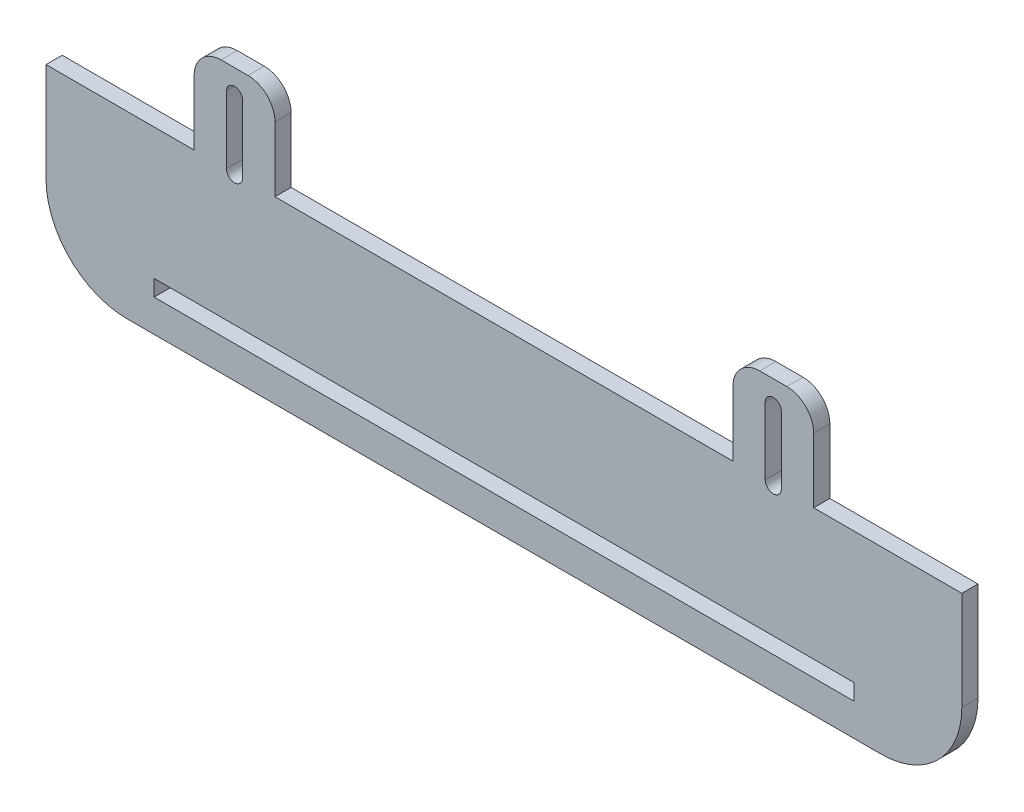
ISO-10303-21;
HEADER;
FILE_DESCRIPTION(('STEP AP214'),'2;1');
FILE_NAME('part.step','',(''),(''),'','','');
FILE_SCHEMA(('AUTOMOTIVE_DESIGN { 1 0 10303 214 1 1 1 1 }'));
ENDSEC;
DATA;
#1=APPLICATION_CONTEXT('core data for automotive mechanical design processes');
#2=APPLICATION_PROTOCOL_DEFINITION('international standard','automotive_design',2000,#1);
#3=PRODUCT_CONTEXT('',#1,'mechanical');
#4=PRODUCT('Part','Part','',(#3));
#5=PRODUCT_RELATED_PRODUCT_CATEGORY('part','',(#4));
#6=PRODUCT_DEFINITION_FORMATION('','',#4);
#7=PRODUCT_DEFINITION_CONTEXT('part definition',#1,'design');
#8=PRODUCT_DEFINITION('design','',#6,#7);
#9=PRODUCT_DEFINITION_SHAPE('','',#8);
#10=(LENGTH_UNIT() NAMED_UNIT(*) SI_UNIT(.MILLI.,.METRE.));
#11=(NAMED_UNIT(*) PLANE_ANGLE_UNIT() SI_UNIT($,.RADIAN.));
#12=(NAMED_UNIT(*) SI_UNIT($,.STERADIAN.) SOLID_ANGLE_UNIT());
#13=UNCERTAINTY_MEASURE_WITH_UNIT(LENGTH_MEASURE(1.E-05),#10,'distance_accuracy_value','');
#14=(GEOMETRIC_REPRESENTATION_CONTEXT(3) GLOBAL_UNCERTAINTY_ASSIGNED_CONTEXT((#13)) GLOBAL_UNIT_ASSIGNED_CONTEXT((#10,
#11,#12)) REPRESENTATION_CONTEXT('',''));
#15=CARTESIAN_POINT('',(0.,0.,0.));
#16=DIRECTION('',(0.,0.,1.));
#17=DIRECTION('',(1.,0.,0.));
#18=AXIS2_PLACEMENT_3D('',#15,#16,#17);
#19=CARTESIAN_POINT('',(-73.622208541519,-61.5984861008832,3.));
#20=DIRECTION('',(0.,0.,-1.));
#21=DIRECTION('',(-1.,0.,0.));
#22=AXIS2_PLACEMENT_3D('',#19,#20,#21);
#23=PLANE('',#22);
#24=DIRECTION('',(1.,0.,0.));
#25=VECTOR('',#24,1.);
#26=CARTESIAN_POINT('',(61.3152833659331,-70.5984861008832,3.));
#27=LINE('',#26,#25);
#28=CARTESIAN_POINT('',(-68.5597004489711,-70.5984861008832,3.));
#29=VERTEX_POINT('',#28);
#30=CARTESIAN_POINT('',(61.3152833659331,-70.5984861008832,3.));
#31=VERTEX_POINT('',#30);
#32=EDGE_CURVE('E251',#29,#31,#27,.T.);
#33=ORIENTED_EDGE('',*,*,#32,.F.);
#34=DIRECTION('',(0.,-1.,0.));
#35=VECTOR('',#34,1.);
#36=CARTESIAN_POINT('',(-68.5597004489711,-67.5984861008832,3.));
#37=LINE('',#36,#35);
#38=CARTESIAN_POINT('',(-68.5597004489711,-67.5984861008832,3.));
#39=VERTEX_POINT('',#38);
#40=EDGE_CURVE('E57',#39,#29,#37,.T.);
#41=ORIENTED_EDGE('',*,*,#40,.F.);
#42=DIRECTION('',(-1.,0.,0.));
#43=VECTOR('',#42,1.);
#44=CARTESIAN_POINT('',(61.3152833659331,-67.5984861008832,3.));
#45=LINE('',#44,#43);
#46=CARTESIAN_POINT('',(61.3152833659331,-67.5984861008832,3.));
#47=VERTEX_POINT('',#46);
#48=EDGE_CURVE('E258',#47,#39,#45,.T.);
#49=ORIENTED_EDGE('',*,*,#48,.F.);
#50=DIRECTION('',(0.,1.,0.));
#51=VECTOR('',#50,1.);
#52=CARTESIAN_POINT('',(61.3152833659331,-67.5984861008832,3.));
#53=LINE('',#52,#51);
#54=EDGE_CURVE('E241',#31,#47,#53,.T.);
#55=ORIENTED_EDGE('',*,*,#54,.F.);
#56=EDGE_LOOP('',(#33,#41,#49,#55));
#57=FACE_BOUND('',#56,.T.);
#58=CARTESIAN_POINT('',(-53.622208541519,-43.25,3.));
#59=DIRECTION('',(0.,0.,1.));
#60=DIRECTION('',(1.,0.,0.));
#61=AXIS2_PLACEMENT_3D('',#58,#59,#60);
#62=CIRCLE('',#61,1.49999999999999);
#63=CARTESIAN_POINT('',(-55.122208541519,-43.25,3.));
#64=VERTEX_POINT('',#63);
#65=CARTESIAN_POINT('',(-52.122208541519,-43.25,3.));
#66=VERTEX_POINT('',#65);
#67=EDGE_CURVE('E316',#64,#66,#62,.T.);
#68=ORIENTED_EDGE('',*,*,#67,.F.);
#69=DIRECTION('',(0.,-1.,0.));
#70=VECTOR('',#69,1.);
#71=CARTESIAN_POINT('',(-55.122208541519,-43.25,3.));
#72=LINE('',#71,#70);
#73=CARTESIAN_POINT('',(-55.122208541519,-30.75,3.));
#74=VERTEX_POINT('',#73);
#75=EDGE_CURVE('E327',#74,#64,#72,.T.);
#76=ORIENTED_EDGE('',*,*,#75,.F.);
#77=CARTESIAN_POINT('',(-53.622208541519,-30.75,3.));
#78=DIRECTION('',(0.,0.,1.));
#79=DIRECTION('',(1.,0.,0.));
#80=AXIS2_PLACEMENT_3D('',#77,#78,#79);
#81=CIRCLE('',#80,1.49999999999999);
#82=CARTESIAN_POINT('',(-52.122208541519,-30.75,3.));
#83=VERTEX_POINT('',#82);
#84=EDGE_CURVE('E323',#83,#74,#81,.T.);
#85=ORIENTED_EDGE('',*,*,#84,.F.);
#86=DIRECTION('',(0.,1.,0.));
#87=VECTOR('',#86,1.);
#88=CARTESIAN_POINT('',(-52.122208541519,-43.25,3.));
#89=LINE('',#88,#87);
#90=EDGE_CURVE('E319',#66,#83,#89,.T.);
#91=ORIENTED_EDGE('',*,*,#90,.F.);
#92=EDGE_LOOP('',(#68,#76,#85,#91));
#93=FACE_BOUND('',#92,.T.);
#94=DIRECTION('',(-1.,0.,0.));
#95=VECTOR('',#94,1.);
#96=CARTESIAN_POINT('',(38.877791458481,-26.25,3.));
#97=LINE('',#96,#95);
#98=CARTESIAN_POINT('',(48.877791458481,-26.25,3.));
#99=VERTEX_POINT('',#98);
#100=CARTESIAN_POINT('',(43.877791458481,-26.25,3.));
#101=VERTEX_POINT('',#100);
#102=EDGE_CURVE('E380',#99,#101,#97,.T.);
#103=ORIENTED_EDGE('',*,*,#102,.T.);
#104=CARTESIAN_POINT('',(43.877791458481,-31.25,3.));
#105=DIRECTION('',(0.,0.,-1.));
#106=DIRECTION('',(-1.,0.,0.));
#107=AXIS2_PLACEMENT_3D('',#104,#105,#106);
#108=CIRCLE('',#107,5.);
#109=CARTESIAN_POINT('',(38.877791458481,-31.25,3.));
#110=VERTEX_POINT('',#109);
#111=EDGE_CURVE('E524',#101,#110,#108,.F.);
#112=ORIENTED_EDGE('',*,*,#111,.T.);
#113=DIRECTION('',(0.,-1.,0.));
#114=VECTOR('',#113,1.);
#115=CARTESIAN_POINT('',(38.877791458481,-43.25,3.));
#116=LINE('',#115,#114);
#117=CARTESIAN_POINT('',(38.877791458481,-43.25,3.));
#118=VERTEX_POINT('',#117);
#119=EDGE_CURVE('E384',#110,#118,#116,.T.);
#120=ORIENTED_EDGE('',*,*,#119,.T.);
#121=DIRECTION('',(-1.,0.,0.));
#122=VECTOR('',#121,1.);
#123=CARTESIAN_POINT('',(-46.122208541519,-43.25,3.));
#124=LINE('',#123,#122);
#125=CARTESIAN_POINT('',(-46.122208541519,-43.25,3.));
#126=VERTEX_POINT('',#125);
#127=EDGE_CURVE('E387',#118,#126,#124,.T.);
#128=ORIENTED_EDGE('',*,*,#127,.T.);
#129=DIRECTION('',(0.,1.,0.));
#130=VECTOR('',#129,1.);
#131=CARTESIAN_POINT('',(-46.122208541519,-26.25,3.));
#132=LINE('',#131,#130);
#133=CARTESIAN_POINT('',(-46.122208541519,-31.25,3.));
#134=VERTEX_POINT('',#133);
#135=EDGE_CURVE('E390',#126,#134,#132,.T.);
#136=ORIENTED_EDGE('',*,*,#135,.T.);
#137=CARTESIAN_POINT('',(-51.122208541519,-31.25,3.));
#138=DIRECTION('',(0.,0.,-1.));
#139=DIRECTION('',(-1.,0.,0.));
#140=AXIS2_PLACEMENT_3D('',#137,#138,#139);
#141=CIRCLE('',#140,5.);
#142=CARTESIAN_POINT('',(-51.122208541519,-26.25,3.));
#143=VERTEX_POINT('',#142);
#144=EDGE_CURVE('E518',#134,#143,#141,.F.);
#145=ORIENTED_EDGE('',*,*,#144,.T.);
#146=DIRECTION('',(-1.,0.,0.));
#147=VECTOR('',#146,1.);
#148=CARTESIAN_POINT('',(-61.122208541519,-26.25,3.));
#149=LINE('',#148,#147);
#150=CARTESIAN_POINT('',(-56.122208541519,-26.25,3.));
#151=VERTEX_POINT('',#150);
#152=EDGE_CURVE('E394',#143,#151,#149,.T.);
#153=ORIENTED_EDGE('',*,*,#152,.T.);
#154=CARTESIAN_POINT('',(-56.122208541519,-31.25,3.));
#155=DIRECTION('',(0.,0.,-1.));
#156=DIRECTION('',(-1.,0.,0.));
#157=AXIS2_PLACEMENT_3D('',#154,#155,#156);
#158=CIRCLE('',#157,5.);
#159=CARTESIAN_POINT('',(-61.122208541519,-31.25,3.));
#160=VERTEX_POINT('',#159);
#161=EDGE_CURVE('E515',#151,#160,#158,.F.);
#162=ORIENTED_EDGE('',*,*,#161,.T.);
#163=DIRECTION('',(0.,-1.,0.));
#164=VECTOR('',#163,1.);
#165=CARTESIAN_POINT('',(-61.122208541519,-26.25,3.));
#166=LINE('',#165,#164);
#167=CARTESIAN_POINT('',(-61.122208541519,-43.25,3.));
#168=VERTEX_POINT('',#167);
#169=EDGE_CURVE('E398',#160,#168,#166,.T.);
#170=ORIENTED_EDGE('',*,*,#169,.T.);
#171=DIRECTION('',(-1.,0.,0.));
#172=VECTOR('',#171,1.);
#173=CARTESIAN_POINT('',(-88.622208541519,-43.25,3.));
#174=LINE('',#173,#172);
#175=CARTESIAN_POINT('',(-88.622208541519,-43.25,3.));
#176=VERTEX_POINT('',#175);
#177=EDGE_CURVE('E401',#168,#176,#174,.T.);
#178=ORIENTED_EDGE('',*,*,#177,.T.);
#179=DIRECTION('',(0.,-1.,0.));
#180=VECTOR('',#179,1.);
#181=CARTESIAN_POINT('',(-88.622208541519,-43.25,3.));
#182=LINE('',#181,#180);
#183=CARTESIAN_POINT('',(-88.622208541519,-61.5984861008832,3.));
#184=VERTEX_POINT('',#183);
#185=EDGE_CURVE('E404',#176,#184,#182,.T.);
#186=ORIENTED_EDGE('',*,*,#185,.T.);
#187=CARTESIAN_POINT('',(-73.622208541519,-61.5984861008832,3.));
#188=DIRECTION('',(0.,0.,1.));
#189=DIRECTION('',(-1.,0.,0.));
#190=AXIS2_PLACEMENT_3D('',#187,#188,#189);
#191=CIRCLE('',#190,15.);
#192=CARTESIAN_POINT('',(-73.622208541519,-76.5984861008832,3.));
#193=VERTEX_POINT('',#192);
#194=EDGE_CURVE('E359',#184,#193,#191,.T.);
#195=ORIENTED_EDGE('',*,*,#194,.T.);
#196=DIRECTION('',(1.,0.,0.));
#197=VECTOR('',#196,1.);
#198=CARTESIAN_POINT('',(66.377791458481,-76.5984861008832,3.));
#199=LINE('',#198,#197);
#200=CARTESIAN_POINT('',(66.377791458481,-76.5984861008832,3.));
#201=VERTEX_POINT('',#200);
#202=EDGE_CURVE('E363',#193,#201,#199,.T.);
#203=ORIENTED_EDGE('',*,*,#202,.T.);
#204=CARTESIAN_POINT('',(66.377791458481,-61.5984861008832,3.));
#205=DIRECTION('',(0.,0.,1.));
#206=DIRECTION('',(1.,0.,0.));
#207=AXIS2_PLACEMENT_3D('',#204,#205,#206);
#208=CIRCLE('',#207,15.);
#209=CARTESIAN_POINT('',(81.377791458481,-61.5984861008832,3.));
#210=VERTEX_POINT('',#209);
#211=EDGE_CURVE('E367',#201,#210,#208,.T.);
#212=ORIENTED_EDGE('',*,*,#211,.T.);
#213=DIRECTION('',(0.,1.,0.));
#214=VECTOR('',#213,1.);
#215=CARTESIAN_POINT('',(81.377791458481,-43.25,3.));
#216=LINE('',#215,#214);
#217=CARTESIAN_POINT('',(81.377791458481,-43.25,3.));
#218=VERTEX_POINT('',#217);
#219=EDGE_CURVE('E370',#210,#218,#216,.T.);
#220=ORIENTED_EDGE('',*,*,#219,.T.);
#221=DIRECTION('',(-1.,0.,0.));
#222=VECTOR('',#221,1.);
#223=CARTESIAN_POINT('',(53.877791458481,-43.25,3.));
#224=LINE('',#223,#222);
#225=CARTESIAN_POINT('',(53.877791458481,-43.25,3.));
#226=VERTEX_POINT('',#225);
#227=EDGE_CURVE('E373',#218,#226,#224,.T.);
#228=ORIENTED_EDGE('',*,*,#227,.T.);
#229=DIRECTION('',(0.,1.,0.));
#230=VECTOR('',#229,1.);
#231=CARTESIAN_POINT('',(53.877791458481,-26.25,3.));
#232=LINE('',#231,#230);
#233=CARTESIAN_POINT('',(53.877791458481,-31.25,3.));
#234=VERTEX_POINT('',#233);
#235=EDGE_CURVE('E376',#226,#234,#232,.T.);
#236=ORIENTED_EDGE('',*,*,#235,.T.);
#237=CARTESIAN_POINT('',(48.877791458481,-31.25,3.));
#238=DIRECTION('',(0.,0.,-1.));
#239=DIRECTION('',(-1.,0.,0.));
#240=AXIS2_PLACEMENT_3D('',#237,#238,#239);
#241=CIRCLE('',#240,5.);
#242=EDGE_CURVE('E521',#234,#99,#241,.F.);
#243=ORIENTED_EDGE('',*,*,#242,.T.);
#244=EDGE_LOOP('',(#103,#112,#120,#128,#136,#145,#153,#162,#170,#178,#186,#195,#203,#212,#220,
#228,#236,#243));
#245=FACE_BOUND('',#244,.T.);
#246=CARTESIAN_POINT('',(46.377791458481,-43.25,3.));
#247=DIRECTION('',(0.,0.,1.));
#248=DIRECTION('',(1.,0.,0.));
#249=AXIS2_PLACEMENT_3D('',#246,#247,#248);
#250=CIRCLE('',#249,1.5);
#251=CARTESIAN_POINT('',(44.877791458481,-43.25,3.));
#252=VERTEX_POINT('',#251);
#253=CARTESIAN_POINT('',(47.877791458481,-43.25,3.));
#254=VERTEX_POINT('',#253);
#255=EDGE_CURVE('E273',#252,#254,#250,.T.);
#256=ORIENTED_EDGE('',*,*,#255,.F.);
#257=DIRECTION('',(0.,-1.,0.));
#258=VECTOR('',#257,1.);
#259=CARTESIAN_POINT('',(44.877791458481,-43.25,3.));
#260=LINE('',#259,#258);
#261=CARTESIAN_POINT('',(44.877791458481,-30.75,3.));
#262=VERTEX_POINT('',#261);
#263=EDGE_CURVE('E284',#262,#252,#260,.T.);
#264=ORIENTED_EDGE('',*,*,#263,.F.);
#265=CARTESIAN_POINT('',(46.377791458481,-30.75,3.));
#266=DIRECTION('',(0.,0.,1.));
#267=DIRECTION('',(1.,0.,0.));
#268=AXIS2_PLACEMENT_3D('',#265,#266,#267);
#269=CIRCLE('',#268,1.5);
#270=CARTESIAN_POINT('',(47.877791458481,-30.75,3.));
#271=VERTEX_POINT('',#270);
#272=EDGE_CURVE('E280',#271,#262,#269,.T.);
#273=ORIENTED_EDGE('',*,*,#272,.F.);
#274=DIRECTION('',(0.,1.,0.));
#275=VECTOR('',#274,1.);
#276=CARTESIAN_POINT('',(47.877791458481,-43.25,3.));
#277=LINE('',#276,#275);
#278=EDGE_CURVE('E276',#254,#271,#277,.T.);
#279=ORIENTED_EDGE('',*,*,#278,.F.);
#280=EDGE_LOOP('',(#256,#264,#273,#279));
#281=FACE_BOUND('',#280,.T.);
#282=ADVANCED_FACE('F41',(#57,#93,#245,#281),#23,.F.);
#283=CARTESIAN_POINT('',(-73.622208541519,-61.5984861008832,0.));
#284=DIRECTION('',(0.,0.,-1.));
#285=DIRECTION('',(-1.,0.,0.));
#286=AXIS2_PLACEMENT_3D('',#283,#284,#285);
#287=PLANE('',#286);
#288=DIRECTION('',(0.,1.,0.));
#289=VECTOR('',#288,1.);
#290=CARTESIAN_POINT('',(-68.5597004489711,-61.5984861008832,0.));
#291=LINE('',#290,#289);
#292=CARTESIAN_POINT('',(-68.5597004489711,-70.5984861008832,0.));
#293=VERTEX_POINT('',#292);
#294=CARTESIAN_POINT('',(-68.5597004489711,-67.5984861008832,0.));
#295=VERTEX_POINT('',#294);
#296=EDGE_CURVE('E11',#293,#295,#291,.T.);
#297=ORIENTED_EDGE('',*,*,#296,.F.);
#298=DIRECTION('',(-1.,0.,0.));
#299=VECTOR('',#298,1.);
#300=CARTESIAN_POINT('',(-73.622208541519,-70.5984861008832,0.));
#301=LINE('',#300,#299);
#302=CARTESIAN_POINT('',(61.3152833659331,-70.5984861008832,0.));
#303=VERTEX_POINT('',#302);
#304=EDGE_CURVE('E544',#303,#293,#301,.T.);
#305=ORIENTED_EDGE('',*,*,#304,.F.);
#306=DIRECTION('',(0.,-1.,0.));
#307=VECTOR('',#306,1.);
#308=CARTESIAN_POINT('',(61.3152833659331,-61.5984861008832,0.));
#309=LINE('',#308,#307);
#310=CARTESIAN_POINT('',(61.3152833659331,-67.5984861008832,0.));
#311=VERTEX_POINT('',#310);
#312=EDGE_CURVE('E244',#311,#303,#309,.T.);
#313=ORIENTED_EDGE('',*,*,#312,.F.);
#314=DIRECTION('',(1.,0.,0.));
#315=VECTOR('',#314,1.);
#316=CARTESIAN_POINT('',(-73.622208541519,-67.5984861008832,0.));
#317=LINE('',#316,#315);
#318=EDGE_CURVE('E50',#295,#311,#317,.T.);
#319=ORIENTED_EDGE('',*,*,#318,.F.);
#320=EDGE_LOOP('',(#297,#305,#313,#319));
#321=FACE_BOUND('',#320,.T.);
#322=DIRECTION('',(0.,-1.,0.));
#323=VECTOR('',#322,1.);
#324=CARTESIAN_POINT('',(38.877791458481,-43.25,0.));
#325=LINE('',#324,#323);
#326=CARTESIAN_POINT('',(38.877791458481,-31.25,0.));
#327=VERTEX_POINT('',#326);
#328=CARTESIAN_POINT('',(38.877791458481,-43.25,0.));
#329=VERTEX_POINT('',#328);
#330=EDGE_CURVE('E431',#327,#329,#325,.T.);
#331=ORIENTED_EDGE('',*,*,#330,.F.);
#332=CARTESIAN_POINT('',(43.877791458481,-31.25,0.));
#333=DIRECTION('',(0.,0.,-1.));
#334=DIRECTION('',(-1.,0.,0.));
#335=AXIS2_PLACEMENT_3D('',#332,#333,#334);
#336=CIRCLE('',#335,5.);
#337=CARTESIAN_POINT('',(43.877791458481,-26.25,0.));
#338=VERTEX_POINT('',#337);
#339=EDGE_CURVE('E505',#327,#338,#336,.T.);
#340=ORIENTED_EDGE('',*,*,#339,.T.);
#341=DIRECTION('',(-1.,0.,0.));
#342=VECTOR('',#341,1.);
#343=CARTESIAN_POINT('',(38.877791458481,-26.25,0.));
#344=LINE('',#343,#342);
#345=CARTESIAN_POINT('',(48.877791458481,-26.25,0.));
#346=VERTEX_POINT('',#345);
#347=EDGE_CURVE('E427',#346,#338,#344,.T.);
#348=ORIENTED_EDGE('',*,*,#347,.F.);
#349=CARTESIAN_POINT('',(48.877791458481,-31.25,0.));
#350=DIRECTION('',(0.,0.,-1.));
#351=DIRECTION('',(-1.,0.,0.));
#352=AXIS2_PLACEMENT_3D('',#349,#350,#351);
#353=CIRCLE('',#352,5.);
#354=CARTESIAN_POINT('',(53.877791458481,-31.25,0.));
#355=VERTEX_POINT('',#354);
#356=EDGE_CURVE('E502',#346,#355,#353,.T.);
#357=ORIENTED_EDGE('',*,*,#356,.T.);
#358=DIRECTION('',(0.,1.,0.));
#359=VECTOR('',#358,1.);
#360=CARTESIAN_POINT('',(53.877791458481,-26.25,0.));
#361=LINE('',#360,#359);
#362=CARTESIAN_POINT('',(53.877791458481,-43.25,0.));
#363=VERTEX_POINT('',#362);
#364=EDGE_CURVE('E423',#363,#355,#361,.T.);
#365=ORIENTED_EDGE('',*,*,#364,.F.);
#366=DIRECTION('',(-1.,0.,0.));
#367=VECTOR('',#366,1.);
#368=CARTESIAN_POINT('',(53.877791458481,-43.25,0.));
#369=LINE('',#368,#367);
#370=CARTESIAN_POINT('',(81.377791458481,-43.25,0.));
#371=VERTEX_POINT('',#370);
#372=EDGE_CURVE('E420',#371,#363,#369,.T.);
#373=ORIENTED_EDGE('',*,*,#372,.F.);
#374=DIRECTION('',(0.,1.,0.));
#375=VECTOR('',#374,1.);
#376=CARTESIAN_POINT('',(81.377791458481,-43.25,0.));
#377=LINE('',#376,#375);
#378=CARTESIAN_POINT('',(81.377791458481,-61.5984861008832,0.));
#379=VERTEX_POINT('',#378);
#380=EDGE_CURVE('E417',#379,#371,#377,.T.);
#381=ORIENTED_EDGE('',*,*,#380,.F.);
#382=CARTESIAN_POINT('',(66.377791458481,-61.5984861008832,0.));
#383=DIRECTION('',(0.,0.,1.));
#384=DIRECTION('',(1.,0.,0.));
#385=AXIS2_PLACEMENT_3D('',#382,#383,#384);
#386=CIRCLE('',#385,15.);
#387=CARTESIAN_POINT('',(66.377791458481,-76.5984861008832,0.));
#388=VERTEX_POINT('',#387);
#389=EDGE_CURVE('E414',#388,#379,#386,.T.);
#390=ORIENTED_EDGE('',*,*,#389,.F.);
#391=DIRECTION('',(1.,0.,0.));
#392=VECTOR('',#391,1.);
#393=CARTESIAN_POINT('',(66.377791458481,-76.5984861008832,0.));
#394=LINE('',#393,#392);
#395=CARTESIAN_POINT('',(-73.622208541519,-76.5984861008832,0.));
#396=VERTEX_POINT('',#395);
#397=EDGE_CURVE('E411',#396,#388,#394,.T.);
#398=ORIENTED_EDGE('',*,*,#397,.F.);
#399=CARTESIAN_POINT('',(-73.622208541519,-61.5984861008832,0.));
#400=DIRECTION('',(0.,0.,1.));
#401=DIRECTION('',(-1.,0.,0.));
#402=AXIS2_PLACEMENT_3D('',#399,#400,#401);
#403=CIRCLE('',#402,15.);
#404=CARTESIAN_POINT('',(-88.622208541519,-61.5984861008832,0.));
#405=VERTEX_POINT('',#404);
#406=EDGE_CURVE('E358',#405,#396,#403,.T.);
#407=ORIENTED_EDGE('',*,*,#406,.F.);
#408=DIRECTION('',(0.,-1.,0.));
#409=VECTOR('',#408,1.);
#410=CARTESIAN_POINT('',(-88.622208541519,-43.25,0.));
#411=LINE('',#410,#409);
#412=CARTESIAN_POINT('',(-88.622208541519,-43.25,0.));
#413=VERTEX_POINT('',#412);
#414=EDGE_CURVE('E364',#413,#405,#411,.T.);
#415=ORIENTED_EDGE('',*,*,#414,.F.);
#416=DIRECTION('',(-1.,0.,0.));
#417=VECTOR('',#416,1.);
#418=CARTESIAN_POINT('',(-88.622208541519,-43.25,0.));
#419=LINE('',#418,#417);
#420=CARTESIAN_POINT('',(-61.122208541519,-43.25,0.));
#421=VERTEX_POINT('',#420);
#422=EDGE_CURVE('E448',#421,#413,#419,.T.);
#423=ORIENTED_EDGE('',*,*,#422,.F.);
#424=DIRECTION('',(0.,-1.,0.));
#425=VECTOR('',#424,1.);
#426=CARTESIAN_POINT('',(-61.122208541519,-26.25,0.));
#427=LINE('',#426,#425);
#428=CARTESIAN_POINT('',(-61.122208541519,-31.25,0.));
#429=VERTEX_POINT('',#428);
#430=EDGE_CURVE('E445',#429,#421,#427,.T.);
#431=ORIENTED_EDGE('',*,*,#430,.F.);
#432=CARTESIAN_POINT('',(-56.122208541519,-31.25,0.));
#433=DIRECTION('',(0.,0.,-1.));
#434=DIRECTION('',(-1.,0.,0.));
#435=AXIS2_PLACEMENT_3D('',#432,#433,#434);
#436=CIRCLE('',#435,5.);
#437=CARTESIAN_POINT('',(-56.122208541519,-26.25,0.));
#438=VERTEX_POINT('',#437);
#439=EDGE_CURVE('E496',#429,#438,#436,.T.);
#440=ORIENTED_EDGE('',*,*,#439,.T.);
#441=DIRECTION('',(-1.,0.,0.));
#442=VECTOR('',#441,1.);
#443=CARTESIAN_POINT('',(-61.122208541519,-26.25,0.));
#444=LINE('',#443,#442);
#445=CARTESIAN_POINT('',(-51.122208541519,-26.25,0.));
#446=VERTEX_POINT('',#445);
#447=EDGE_CURVE('E441',#446,#438,#444,.T.);
#448=ORIENTED_EDGE('',*,*,#447,.F.);
#449=CARTESIAN_POINT('',(-51.122208541519,-31.25,0.));
#450=DIRECTION('',(0.,0.,-1.));
#451=DIRECTION('',(-1.,0.,0.));
#452=AXIS2_PLACEMENT_3D('',#449,#450,#451);
#453=CIRCLE('',#452,5.);
#454=CARTESIAN_POINT('',(-46.122208541519,-31.25,0.));
#455=VERTEX_POINT('',#454);
#456=EDGE_CURVE('E499',#446,#455,#453,.T.);
#457=ORIENTED_EDGE('',*,*,#456,.T.);
#458=DIRECTION('',(0.,1.,0.));
#459=VECTOR('',#458,1.);
#460=CARTESIAN_POINT('',(-46.122208541519,-26.25,0.));
#461=LINE('',#460,#459);
#462=CARTESIAN_POINT('',(-46.122208541519,-43.25,0.));
#463=VERTEX_POINT('',#462);
#464=EDGE_CURVE('E437',#463,#455,#461,.T.);
#465=ORIENTED_EDGE('',*,*,#464,.F.);
#466=DIRECTION('',(-1.,0.,0.));
#467=VECTOR('',#466,1.);
#468=CARTESIAN_POINT('',(-46.122208541519,-43.25,0.));
#469=LINE('',#468,#467);
#470=EDGE_CURVE('E434',#329,#463,#469,.T.);
#471=ORIENTED_EDGE('',*,*,#470,.F.);
#472=EDGE_LOOP('',(#331,#340,#348,#357,#365,#373,#381,#390,#398,#407,#415,#423,#431,#440,#448,
#457,#465,#471));
#473=FACE_BOUND('',#472,.T.);
#474=DIRECTION('',(0.,-1.,0.));
#475=VECTOR('',#474,1.);
#476=CARTESIAN_POINT('',(-55.122208541519,-43.25,0.));
#477=LINE('',#476,#475);
#478=CARTESIAN_POINT('',(-55.122208541519,-30.75,0.));
#479=VERTEX_POINT('',#478);
#480=CARTESIAN_POINT('',(-55.122208541519,-43.25,0.));
#481=VERTEX_POINT('',#480);
#482=EDGE_CURVE('E320',#479,#481,#477,.T.);
#483=ORIENTED_EDGE('',*,*,#482,.T.);
#484=CARTESIAN_POINT('',(-53.622208541519,-43.25,0.));
#485=DIRECTION('',(0.,0.,1.));
#486=DIRECTION('',(1.,0.,0.));
#487=AXIS2_PLACEMENT_3D('',#484,#485,#486);
#488=CIRCLE('',#487,1.49999999999999);
#489=CARTESIAN_POINT('',(-52.122208541519,-43.25,0.));
#490=VERTEX_POINT('',#489);
#491=EDGE_CURVE('E315',#481,#490,#488,.T.);
#492=ORIENTED_EDGE('',*,*,#491,.T.);
#493=DIRECTION('',(0.,1.,0.));
#494=VECTOR('',#493,1.);
#495=CARTESIAN_POINT('',(-52.122208541519,-43.25,0.));
#496=LINE('',#495,#494);
#497=CARTESIAN_POINT('',(-52.122208541519,-30.75,0.));
#498=VERTEX_POINT('',#497);
#499=EDGE_CURVE('E334',#490,#498,#496,.T.);
#500=ORIENTED_EDGE('',*,*,#499,.T.);
#501=CARTESIAN_POINT('',(-53.622208541519,-30.75,0.));
#502=DIRECTION('',(0.,0.,1.));
#503=DIRECTION('',(1.,0.,0.));
#504=AXIS2_PLACEMENT_3D('',#501,#502,#503);
#505=CIRCLE('',#504,1.49999999999999);
#506=EDGE_CURVE('E338',#498,#479,#505,.T.);
#507=ORIENTED_EDGE('',*,*,#506,.T.);
#508=EDGE_LOOP('',(#483,#492,#500,#507));
#509=FACE_BOUND('',#508,.T.);
#510=DIRECTION('',(0.,-1.,0.));
#511=VECTOR('',#510,1.);
#512=CARTESIAN_POINT('',(44.877791458481,-43.25,0.));
#513=LINE('',#512,#511);
#514=CARTESIAN_POINT('',(44.877791458481,-30.75,0.));
#515=VERTEX_POINT('',#514);
#516=CARTESIAN_POINT('',(44.877791458481,-43.25,0.));
#517=VERTEX_POINT('',#516);
#518=EDGE_CURVE('E277',#515,#517,#513,.T.);
#519=ORIENTED_EDGE('',*,*,#518,.T.);
#520=CARTESIAN_POINT('',(46.377791458481,-43.25,0.));
#521=DIRECTION('',(0.,0.,1.));
#522=DIRECTION('',(1.,0.,0.));
#523=AXIS2_PLACEMENT_3D('',#520,#521,#522);
#524=CIRCLE('',#523,1.5);
#525=CARTESIAN_POINT('',(47.877791458481,-43.25,0.));
#526=VERTEX_POINT('',#525);
#527=EDGE_CURVE('E268',#517,#526,#524,.T.);
#528=ORIENTED_EDGE('',*,*,#527,.T.);
#529=DIRECTION('',(0.,1.,0.));
#530=VECTOR('',#529,1.);
#531=CARTESIAN_POINT('',(47.877791458481,-43.25,0.));
#532=LINE('',#531,#530);
#533=CARTESIAN_POINT('',(47.877791458481,-30.75,0.));
#534=VERTEX_POINT('',#533);
#535=EDGE_CURVE('E291',#526,#534,#532,.T.);
#536=ORIENTED_EDGE('',*,*,#535,.T.);
#537=CARTESIAN_POINT('',(46.377791458481,-30.75,0.));
#538=DIRECTION('',(0.,0.,1.));
#539=DIRECTION('',(1.,0.,0.));
#540=AXIS2_PLACEMENT_3D('',#537,#538,#539);
#541=CIRCLE('',#540,1.5);
#542=EDGE_CURVE('E295',#534,#515,#541,.T.);
#543=ORIENTED_EDGE('',*,*,#542,.T.);
#544=EDGE_LOOP('',(#519,#528,#536,#543));
#545=FACE_BOUND('',#544,.T.);
#546=ADVANCED_FACE('F555',(#321,#473,#509,#545),#287,.T.);
#547=CARTESIAN_POINT('',(-73.622208541519,-61.5984861008832,3.));
#548=DIRECTION('',(0.,0.,-1.));
#549=DIRECTION('',(-1.,0.,0.));
#550=AXIS2_PLACEMENT_3D('',#547,#548,#549);
#551=CYLINDRICAL_SURFACE('',#550,15.);
#552=ORIENTED_EDGE('',*,*,#406,.T.);
#553=DIRECTION('',(0.,0.,-1.));
#554=VECTOR('',#553,1.);
#555=CARTESIAN_POINT('',(-73.622208541519,-76.5984861008832,3.));
#556=LINE('',#555,#554);
#557=EDGE_CURVE('E488',#193,#396,#556,.T.);
#558=ORIENTED_EDGE('',*,*,#557,.F.);
#559=ORIENTED_EDGE('',*,*,#194,.F.);
#560=DIRECTION('',(0.,0.,-1.));
#561=VECTOR('',#560,1.);
#562=CARTESIAN_POINT('',(-88.622208541519,-61.5984861008832,3.));
#563=LINE('',#562,#561);
#564=EDGE_CURVE('E407',#184,#405,#563,.T.);
#565=ORIENTED_EDGE('',*,*,#564,.T.);
#566=EDGE_LOOP('',(#552,#558,#559,#565));
#567=FACE_BOUND('',#566,.T.);
#568=ADVANCED_FACE('F575',(#567),#551,.T.);
#569=CARTESIAN_POINT('',(66.377791458481,-76.5984861008832,3.));
#570=DIRECTION('',(0.,1.,0.));
#571=DIRECTION('',(-1.,0.,0.));
#572=AXIS2_PLACEMENT_3D('',#569,#570,#571);
#573=PLANE('',#572);
#574=ORIENTED_EDGE('',*,*,#397,.T.);
#575=DIRECTION('',(0.,0.,-1.));
#576=VECTOR('',#575,1.);
#577=CARTESIAN_POINT('',(66.377791458481,-76.5984861008832,3.));
#578=LINE('',#577,#576);
#579=EDGE_CURVE('E484',#201,#388,#578,.T.);
#580=ORIENTED_EDGE('',*,*,#579,.F.);
#581=ORIENTED_EDGE('',*,*,#202,.F.);
#582=ORIENTED_EDGE('',*,*,#557,.T.);
#583=EDGE_LOOP('',(#574,#580,#581,#582));
#584=FACE_BOUND('',#583,.T.);
#585=ADVANCED_FACE('F628',(#584),#573,.F.);
#586=CARTESIAN_POINT('',(66.377791458481,-61.5984861008832,3.));
#587=DIRECTION('',(0.,0.,-1.));
#588=DIRECTION('',(-1.,0.,0.));
#589=AXIS2_PLACEMENT_3D('',#586,#587,#588);
#590=CYLINDRICAL_SURFACE('',#589,15.);
#591=ORIENTED_EDGE('',*,*,#389,.T.);
#592=DIRECTION('',(0.,0.,-1.));
#593=VECTOR('',#592,1.);
#594=CARTESIAN_POINT('',(81.377791458481,-61.5984861008832,3.));
#595=LINE('',#594,#593);
#596=EDGE_CURVE('E480',#210,#379,#595,.T.);
#597=ORIENTED_EDGE('',*,*,#596,.F.);
#598=ORIENTED_EDGE('',*,*,#211,.F.);
#599=ORIENTED_EDGE('',*,*,#579,.T.);
#600=EDGE_LOOP('',(#591,#597,#598,#599));
#601=FACE_BOUND('',#600,.T.);
#602=ADVANCED_FACE('F624',(#601),#590,.T.);
#603=CARTESIAN_POINT('',(81.377791458481,-43.25,3.));
#604=DIRECTION('',(-1.,0.,0.));
#605=DIRECTION('',(0.,-1.,0.));
#606=AXIS2_PLACEMENT_3D('',#603,#604,#605);
#607=PLANE('',#606);
#608=ORIENTED_EDGE('',*,*,#380,.T.);
#609=DIRECTION('',(0.,0.,-1.));
#610=VECTOR('',#609,1.);
#611=CARTESIAN_POINT('',(81.377791458481,-43.25,3.));
#612=LINE('',#611,#610);
#613=EDGE_CURVE('E476',#218,#371,#612,.T.);
#614=ORIENTED_EDGE('',*,*,#613,.F.);
#615=ORIENTED_EDGE('',*,*,#219,.F.);
#616=ORIENTED_EDGE('',*,*,#596,.T.);
#617=EDGE_LOOP('',(#608,#614,#615,#616));
#618=FACE_BOUND('',#617,.T.);
#619=ADVANCED_FACE('F620',(#618),#607,.F.);
#620=CARTESIAN_POINT('',(53.877791458481,-43.25,3.));
#621=DIRECTION('',(0.,-1.,0.));
#622=DIRECTION('',(1.,0.,0.));
#623=AXIS2_PLACEMENT_3D('',#620,#621,#622);
#624=PLANE('',#623);
#625=ORIENTED_EDGE('',*,*,#372,.T.);
#626=DIRECTION('',(0.,0.,-1.));
#627=VECTOR('',#626,1.);
#628=CARTESIAN_POINT('',(53.877791458481,-43.25,3.));
#629=LINE('',#628,#627);
#630=EDGE_CURVE('E472',#226,#363,#629,.T.);
#631=ORIENTED_EDGE('',*,*,#630,.F.);
#632=ORIENTED_EDGE('',*,*,#227,.F.);
#633=ORIENTED_EDGE('',*,*,#613,.T.);
#634=EDGE_LOOP('',(#625,#631,#632,#633));
#635=FACE_BOUND('',#634,.T.);
#636=ADVANCED_FACE('F616',(#635),#624,.F.);
#637=CARTESIAN_POINT('',(53.877791458481,-26.25,3.));
#638=DIRECTION('',(-1.,0.,0.));
#639=DIRECTION('',(0.,0.,1.));
#640=AXIS2_PLACEMENT_3D('',#637,#638,#639);
#641=PLANE('',#640);
#642=ORIENTED_EDGE('',*,*,#364,.T.);
#643=DIRECTION('',(0.,0.,-1.));
#644=VECTOR('',#643,1.);
#645=CARTESIAN_POINT('',(53.877791458481,-31.25,3.));
#646=LINE('',#645,#644);
#647=EDGE_CURVE('E527',#355,#234,#646,.F.);
#648=ORIENTED_EDGE('',*,*,#647,.T.);
#649=ORIENTED_EDGE('',*,*,#235,.F.);
#650=ORIENTED_EDGE('',*,*,#630,.T.);
#651=EDGE_LOOP('',(#642,#648,#649,#650));
#652=FACE_BOUND('',#651,.T.);
#653=ADVANCED_FACE('F612',(#652),#641,.F.);
#654=CARTESIAN_POINT('',(38.877791458481,-26.25,3.));
#655=DIRECTION('',(0.,-1.,0.));
#656=DIRECTION('',(1.,0.,0.));
#657=AXIS2_PLACEMENT_3D('',#654,#655,#656);
#658=PLANE('',#657);
#659=ORIENTED_EDGE('',*,*,#347,.T.);
#660=DIRECTION('',(0.,0.,-1.));
#661=VECTOR('',#660,1.);
#662=CARTESIAN_POINT('',(43.877791458481,-26.25,3.));
#663=LINE('',#662,#661);
#664=EDGE_CURVE('E512',#338,#101,#663,.F.);
#665=ORIENTED_EDGE('',*,*,#664,.T.);
#666=ORIENTED_EDGE('',*,*,#102,.F.);
#667=DIRECTION('',(0.,0.,-1.));
#668=VECTOR('',#667,1.);
#669=CARTESIAN_POINT('',(48.877791458481,-26.25,3.));
#670=LINE('',#669,#668);
#671=EDGE_CURVE('E508',#99,#346,#670,.T.);
#672=ORIENTED_EDGE('',*,*,#671,.T.);
#673=EDGE_LOOP('',(#659,#665,#666,#672));
#674=FACE_BOUND('',#673,.T.);
#675=ADVANCED_FACE('F608',(#674),#658,.F.);
#676=CARTESIAN_POINT('',(38.877791458481,-43.25,3.));
#677=DIRECTION('',(1.,0.,0.));
#678=DIRECTION('',(0.,0.,-1.));
#679=AXIS2_PLACEMENT_3D('',#676,#677,#678);
#680=PLANE('',#679);
#681=ORIENTED_EDGE('',*,*,#119,.F.);
#682=DIRECTION('',(0.,0.,-1.));
#683=VECTOR('',#682,1.);
#684=CARTESIAN_POINT('',(38.877791458481,-31.25,3.));
#685=LINE('',#684,#683);
#686=EDGE_CURVE('E492',#110,#327,#685,.T.);
#687=ORIENTED_EDGE('',*,*,#686,.T.);
#688=ORIENTED_EDGE('',*,*,#330,.T.);
#689=DIRECTION('',(0.,0.,-1.));
#690=VECTOR('',#689,1.);
#691=CARTESIAN_POINT('',(38.877791458481,-43.25,3.));
#692=LINE('',#691,#690);
#693=EDGE_CURVE('E468',#118,#329,#692,.T.);
#694=ORIENTED_EDGE('',*,*,#693,.F.);
#695=EDGE_LOOP('',(#681,#687,#688,#694));
#696=FACE_BOUND('',#695,.T.);
#697=ADVANCED_FACE('F604',(#696),#680,.F.);
#698=CARTESIAN_POINT('',(-46.122208541519,-43.25,3.));
#699=DIRECTION('',(0.,-1.,0.));
#700=DIRECTION('',(0.,0.,-1.));
#701=AXIS2_PLACEMENT_3D('',#698,#699,#700);
#702=PLANE('',#701);
#703=ORIENTED_EDGE('',*,*,#470,.T.);
#704=DIRECTION('',(0.,0.,-1.));
#705=VECTOR('',#704,1.);
#706=CARTESIAN_POINT('',(-46.122208541519,-43.25,3.));
#707=LINE('',#706,#705);
#708=EDGE_CURVE('E464',#126,#463,#707,.T.);
#709=ORIENTED_EDGE('',*,*,#708,.F.);
#710=ORIENTED_EDGE('',*,*,#127,.F.);
#711=ORIENTED_EDGE('',*,*,#693,.T.);
#712=EDGE_LOOP('',(#703,#709,#710,#711));
#713=FACE_BOUND('',#712,.T.);
#714=ADVANCED_FACE('F600',(#713),#702,.F.);
#715=CARTESIAN_POINT('',(-46.122208541519,-26.25,3.));
#716=DIRECTION('',(-1.,0.,0.));
#717=DIRECTION('',(0.,-1.,0.));
#718=AXIS2_PLACEMENT_3D('',#715,#716,#717);
#719=PLANE('',#718);
#720=ORIENTED_EDGE('',*,*,#464,.T.);
#721=DIRECTION('',(0.,0.,-1.));
#722=VECTOR('',#721,1.);
#723=CARTESIAN_POINT('',(-46.122208541519,-31.25,3.));
#724=LINE('',#723,#722);
#725=EDGE_CURVE('E537',#455,#134,#724,.F.);
#726=ORIENTED_EDGE('',*,*,#725,.T.);
#727=ORIENTED_EDGE('',*,*,#135,.F.);
#728=ORIENTED_EDGE('',*,*,#708,.T.);
#729=EDGE_LOOP('',(#720,#726,#727,#728));
#730=FACE_BOUND('',#729,.T.);
#731=ADVANCED_FACE('F596',(#730),#719,.F.);
#732=CARTESIAN_POINT('',(-61.122208541519,-26.25,3.));
#733=DIRECTION('',(0.,-1.,0.));
#734=DIRECTION('',(0.,0.,-1.));
#735=AXIS2_PLACEMENT_3D('',#732,#733,#734);
#736=PLANE('',#735);
#737=ORIENTED_EDGE('',*,*,#152,.F.);
#738=DIRECTION('',(0.,0.,-1.));
#739=VECTOR('',#738,1.);
#740=CARTESIAN_POINT('',(-51.122208541519,-26.25,3.));
#741=LINE('',#740,#739);
#742=EDGE_CURVE('E533',#143,#446,#741,.T.);
#743=ORIENTED_EDGE('',*,*,#742,.T.);
#744=ORIENTED_EDGE('',*,*,#447,.T.);
#745=DIRECTION('',(0.,0.,-1.));
#746=VECTOR('',#745,1.);
#747=CARTESIAN_POINT('',(-56.122208541519,-26.25,3.));
#748=LINE('',#747,#746);
#749=EDGE_CURVE('E530',#438,#151,#748,.F.);
#750=ORIENTED_EDGE('',*,*,#749,.T.);
#751=EDGE_LOOP('',(#737,#743,#744,#750));
#752=FACE_BOUND('',#751,.T.);
#753=ADVANCED_FACE('F592',(#752),#736,.F.);
#754=CARTESIAN_POINT('',(-61.122208541519,-26.25,3.));
#755=DIRECTION('',(1.,0.,0.));
#756=DIRECTION('',(0.,0.,-1.));
#757=AXIS2_PLACEMENT_3D('',#754,#755,#756);
#758=PLANE('',#757);
#759=ORIENTED_EDGE('',*,*,#169,.F.);
#760=DIRECTION('',(0.,0.,-1.));
#761=VECTOR('',#760,1.);
#762=CARTESIAN_POINT('',(-61.122208541519,-31.25,3.));
#763=LINE('',#762,#761);
#764=EDGE_CURVE('E540',#160,#429,#763,.T.);
#765=ORIENTED_EDGE('',*,*,#764,.T.);
#766=ORIENTED_EDGE('',*,*,#430,.T.);
#767=DIRECTION('',(0.,0.,-1.));
#768=VECTOR('',#767,1.);
#769=CARTESIAN_POINT('',(-61.122208541519,-43.25,3.));
#770=LINE('',#769,#768);
#771=EDGE_CURVE('E460',#168,#421,#770,.T.);
#772=ORIENTED_EDGE('',*,*,#771,.F.);
#773=EDGE_LOOP('',(#759,#765,#766,#772));
#774=FACE_BOUND('',#773,.T.);
#775=ADVANCED_FACE('F588',(#774),#758,.F.);
#776=CARTESIAN_POINT('',(-88.622208541519,-43.25,3.));
#777=DIRECTION('',(0.,-1.,0.));
#778=DIRECTION('',(1.,0.,0.));
#779=AXIS2_PLACEMENT_3D('',#776,#777,#778);
#780=PLANE('',#779);
#781=ORIENTED_EDGE('',*,*,#422,.T.);
#782=DIRECTION('',(0.,0.,-1.));
#783=VECTOR('',#782,1.);
#784=CARTESIAN_POINT('',(-88.622208541519,-43.25,3.));
#785=LINE('',#784,#783);
#786=EDGE_CURVE('E456',#176,#413,#785,.T.);
#787=ORIENTED_EDGE('',*,*,#786,.F.);
#788=ORIENTED_EDGE('',*,*,#177,.F.);
#789=ORIENTED_EDGE('',*,*,#771,.T.);
#790=EDGE_LOOP('',(#781,#787,#788,#789));
#791=FACE_BOUND('',#790,.T.);
#792=ADVANCED_FACE('F584',(#791),#780,.F.);
#793=CARTESIAN_POINT('',(-88.622208541519,-43.25,3.));
#794=DIRECTION('',(1.,0.,0.));
#795=DIRECTION('',(0.,1.,0.));
#796=AXIS2_PLACEMENT_3D('',#793,#794,#795);
#797=PLANE('',#796);
#798=ORIENTED_EDGE('',*,*,#414,.T.);
#799=ORIENTED_EDGE('',*,*,#564,.F.);
#800=ORIENTED_EDGE('',*,*,#185,.F.);
#801=ORIENTED_EDGE('',*,*,#786,.T.);
#802=EDGE_LOOP('',(#798,#799,#800,#801));
#803=FACE_BOUND('',#802,.T.);
#804=ADVANCED_FACE('F581',(#803),#797,.F.);
#805=CARTESIAN_POINT('',(-53.622208541519,-43.25,3.));
#806=DIRECTION('',(0.,0.,-1.));
#807=DIRECTION('',(-1.,0.,0.));
#808=AXIS2_PLACEMENT_3D('',#805,#806,#807);
#809=CYLINDRICAL_SURFACE('',#808,1.49999999999999);
#810=ORIENTED_EDGE('',*,*,#491,.F.);
#811=DIRECTION('',(0.,0.,-1.));
#812=VECTOR('',#811,1.);
#813=CARTESIAN_POINT('',(-55.122208541519,-43.25,3.));
#814=LINE('',#813,#812);
#815=EDGE_CURVE('E330',#64,#481,#814,.T.);
#816=ORIENTED_EDGE('',*,*,#815,.F.);
#817=ORIENTED_EDGE('',*,*,#67,.T.);
#818=DIRECTION('',(0.,0.,-1.));
#819=VECTOR('',#818,1.);
#820=CARTESIAN_POINT('',(-52.122208541519,-43.25,3.));
#821=LINE('',#820,#819);
#822=EDGE_CURVE('E354',#66,#490,#821,.T.);
#823=ORIENTED_EDGE('',*,*,#822,.T.);
#824=EDGE_LOOP('',(#810,#816,#817,#823));
#825=FACE_BOUND('',#824,.T.);
#826=ADVANCED_FACE('F578',(#825),#809,.F.);
#827=CARTESIAN_POINT('',(-52.122208541519,-43.25,3.));
#828=DIRECTION('',(-1.,0.,0.));
#829=DIRECTION('',(0.,0.,1.));
#830=AXIS2_PLACEMENT_3D('',#827,#828,#829);
#831=PLANE('',#830);
#832=ORIENTED_EDGE('',*,*,#499,.F.);
#833=ORIENTED_EDGE('',*,*,#822,.F.);
#834=ORIENTED_EDGE('',*,*,#90,.T.);
#835=DIRECTION('',(0.,0.,-1.));
#836=VECTOR('',#835,1.);
#837=CARTESIAN_POINT('',(-52.122208541519,-30.75,3.));
#838=LINE('',#837,#836);
#839=EDGE_CURVE('E351',#83,#498,#838,.T.);
#840=ORIENTED_EDGE('',*,*,#839,.T.);
#841=EDGE_LOOP('',(#832,#833,#834,#840));
#842=FACE_BOUND('',#841,.T.);
#843=ADVANCED_FACE('F733',(#842),#831,.T.);
#844=CARTESIAN_POINT('',(-53.622208541519,-30.75,3.));
#845=DIRECTION('',(0.,0.,-1.));
#846=DIRECTION('',(-1.,0.,0.));
#847=AXIS2_PLACEMENT_3D('',#844,#845,#846);
#848=CYLINDRICAL_SURFACE('',#847,1.49999999999999);
#849=ORIENTED_EDGE('',*,*,#506,.F.);
#850=ORIENTED_EDGE('',*,*,#839,.F.);
#851=ORIENTED_EDGE('',*,*,#84,.T.);
#852=DIRECTION('',(0.,0.,-1.));
#853=VECTOR('',#852,1.);
#854=CARTESIAN_POINT('',(-55.122208541519,-30.75,3.));
#855=LINE('',#854,#853);
#856=EDGE_CURVE('E348',#74,#479,#855,.T.);
#857=ORIENTED_EDGE('',*,*,#856,.T.);
#858=EDGE_LOOP('',(#849,#850,#851,#857));
#859=FACE_BOUND('',#858,.T.);
#860=ADVANCED_FACE('F730',(#859),#848,.F.);
#861=CARTESIAN_POINT('',(-55.122208541519,-43.25,3.));
#862=DIRECTION('',(1.,0.,0.));
#863=DIRECTION('',(0.,0.,-1.));
#864=AXIS2_PLACEMENT_3D('',#861,#862,#863);
#865=PLANE('',#864);
#866=ORIENTED_EDGE('',*,*,#482,.F.);
#867=ORIENTED_EDGE('',*,*,#856,.F.);
#868=ORIENTED_EDGE('',*,*,#75,.T.);
#869=ORIENTED_EDGE('',*,*,#815,.T.);
#870=EDGE_LOOP('',(#866,#867,#868,#869));
#871=FACE_BOUND('',#870,.T.);
#872=ADVANCED_FACE('F727',(#871),#865,.T.);
#873=CARTESIAN_POINT('',(46.377791458481,-43.25,3.));
#874=DIRECTION('',(0.,0.,-1.));
#875=DIRECTION('',(-1.,0.,0.));
#876=AXIS2_PLACEMENT_3D('',#873,#874,#875);
#877=CYLINDRICAL_SURFACE('',#876,1.5);
#878=ORIENTED_EDGE('',*,*,#527,.F.);
#879=DIRECTION('',(0.,0.,-1.));
#880=VECTOR('',#879,1.);
#881=CARTESIAN_POINT('',(44.877791458481,-43.25,3.));
#882=LINE('',#881,#880);
#883=EDGE_CURVE('E287',#252,#517,#882,.T.);
#884=ORIENTED_EDGE('',*,*,#883,.F.);
#885=ORIENTED_EDGE('',*,*,#255,.T.);
#886=DIRECTION('',(0.,0.,-1.));
#887=VECTOR('',#886,1.);
#888=CARTESIAN_POINT('',(47.877791458481,-43.25,3.));
#889=LINE('',#888,#887);
#890=EDGE_CURVE('E311',#254,#526,#889,.T.);
#891=ORIENTED_EDGE('',*,*,#890,.T.);
#892=EDGE_LOOP('',(#878,#884,#885,#891));
#893=FACE_BOUND('',#892,.T.);
#894=ADVANCED_FACE('F708',(#893),#877,.F.);
#895=CARTESIAN_POINT('',(47.877791458481,-43.25,3.));
#896=DIRECTION('',(-1.,0.,0.));
#897=DIRECTION('',(0.,-1.,0.));
#898=AXIS2_PLACEMENT_3D('',#895,#896,#897);
#899=PLANE('',#898);
#900=ORIENTED_EDGE('',*,*,#535,.F.);
#901=ORIENTED_EDGE('',*,*,#890,.F.);
#902=ORIENTED_EDGE('',*,*,#278,.T.);
#903=DIRECTION('',(0.,0.,-1.));
#904=VECTOR('',#903,1.);
#905=CARTESIAN_POINT('',(47.877791458481,-30.75,3.));
#906=LINE('',#905,#904);
#907=EDGE_CURVE('E308',#271,#534,#906,.T.);
#908=ORIENTED_EDGE('',*,*,#907,.T.);
#909=EDGE_LOOP('',(#900,#901,#902,#908));
#910=FACE_BOUND('',#909,.T.);
#911=ADVANCED_FACE('F714',(#910),#899,.T.);
#912=CARTESIAN_POINT('',(46.377791458481,-30.75,3.));
#913=DIRECTION('',(0.,0.,-1.));
#914=DIRECTION('',(-1.,0.,0.));
#915=AXIS2_PLACEMENT_3D('',#912,#913,#914);
#916=CYLINDRICAL_SURFACE('',#915,1.5);
#917=ORIENTED_EDGE('',*,*,#542,.F.);
#918=ORIENTED_EDGE('',*,*,#907,.F.);
#919=ORIENTED_EDGE('',*,*,#272,.T.);
#920=DIRECTION('',(0.,0.,-1.));
#921=VECTOR('',#920,1.);
#922=CARTESIAN_POINT('',(44.877791458481,-30.75,3.));
#923=LINE('',#922,#921);
#924=EDGE_CURVE('E305',#262,#515,#923,.T.);
#925=ORIENTED_EDGE('',*,*,#924,.T.);
#926=EDGE_LOOP('',(#917,#918,#919,#925));
#927=FACE_BOUND('',#926,.T.);
#928=ADVANCED_FACE('F716',(#927),#916,.F.);
#929=CARTESIAN_POINT('',(44.877791458481,-43.25,3.));
#930=DIRECTION('',(1.,0.,0.));
#931=DIRECTION('',(0.,0.,-1.));
#932=AXIS2_PLACEMENT_3D('',#929,#930,#931);
#933=PLANE('',#932);
#934=ORIENTED_EDGE('',*,*,#518,.F.);
#935=ORIENTED_EDGE('',*,*,#924,.F.);
#936=ORIENTED_EDGE('',*,*,#263,.T.);
#937=ORIENTED_EDGE('',*,*,#883,.T.);
#938=EDGE_LOOP('',(#934,#935,#936,#937));
#939=FACE_BOUND('',#938,.T.);
#940=ADVANCED_FACE('F640',(#939),#933,.T.);
#941=CARTESIAN_POINT('',(43.877791458481,-31.25,3.));
#942=DIRECTION('',(0.,0.,-1.));
#943=DIRECTION('',(-1.,0.,0.));
#944=AXIS2_PLACEMENT_3D('',#941,#942,#943);
#945=CYLINDRICAL_SURFACE('',#944,5.);
#946=ORIENTED_EDGE('',*,*,#111,.F.);
#947=ORIENTED_EDGE('',*,*,#664,.F.);
#948=ORIENTED_EDGE('',*,*,#339,.F.);
#949=ORIENTED_EDGE('',*,*,#686,.F.);
#950=EDGE_LOOP('',(#946,#947,#948,#949));
#951=FACE_BOUND('',#950,.T.);
#952=ADVANCED_FACE('F636',(#951),#945,.T.);
#953=CARTESIAN_POINT('',(48.877791458481,-31.25,3.));
#954=DIRECTION('',(0.,0.,-1.));
#955=DIRECTION('',(-1.,0.,0.));
#956=AXIS2_PLACEMENT_3D('',#953,#954,#955);
#957=CYLINDRICAL_SURFACE('',#956,5.);
#958=ORIENTED_EDGE('',*,*,#242,.F.);
#959=ORIENTED_EDGE('',*,*,#647,.F.);
#960=ORIENTED_EDGE('',*,*,#356,.F.);
#961=ORIENTED_EDGE('',*,*,#671,.F.);
#962=EDGE_LOOP('',(#958,#959,#960,#961));
#963=FACE_BOUND('',#962,.T.);
#964=ADVANCED_FACE('F639',(#963),#957,.T.);
#965=CARTESIAN_POINT('',(-51.122208541519,-31.25,3.));
#966=DIRECTION('',(0.,0.,-1.));
#967=DIRECTION('',(-1.,0.,0.));
#968=AXIS2_PLACEMENT_3D('',#965,#966,#967);
#969=CYLINDRICAL_SURFACE('',#968,5.);
#970=ORIENTED_EDGE('',*,*,#144,.F.);
#971=ORIENTED_EDGE('',*,*,#725,.F.);
#972=ORIENTED_EDGE('',*,*,#456,.F.);
#973=ORIENTED_EDGE('',*,*,#742,.F.);
#974=EDGE_LOOP('',(#970,#971,#972,#973));
#975=FACE_BOUND('',#974,.T.);
#976=ADVANCED_FACE('F566',(#975),#969,.T.);
#977=CARTESIAN_POINT('',(-56.122208541519,-31.25,3.));
#978=DIRECTION('',(0.,0.,-1.));
#979=DIRECTION('',(-1.,0.,0.));
#980=AXIS2_PLACEMENT_3D('',#977,#978,#979);
#981=CYLINDRICAL_SURFACE('',#980,5.);
#982=ORIENTED_EDGE('',*,*,#161,.F.);
#983=ORIENTED_EDGE('',*,*,#749,.F.);
#984=ORIENTED_EDGE('',*,*,#439,.F.);
#985=ORIENTED_EDGE('',*,*,#764,.F.);
#986=EDGE_LOOP('',(#982,#983,#984,#985));
#987=FACE_BOUND('',#986,.T.);
#988=ADVANCED_FACE('F43',(#987),#981,.T.);
#989=CARTESIAN_POINT('',(-68.5597004489711,-67.5984861008832,-7.));
#990=DIRECTION('',(-1.,0.,0.));
#991=DIRECTION('',(0.,0.,1.));
#992=AXIS2_PLACEMENT_3D('',#989,#990,#991);
#993=PLANE('',#992);
#994=ORIENTED_EDGE('',*,*,#296,.T.);
#995=DIRECTION('',(0.,0.,1.));
#996=VECTOR('',#995,1.);
#997=CARTESIAN_POINT('',(-68.5597004489711,-67.5984861008832,-7.));
#998=LINE('',#997,#996);
#999=EDGE_CURVE('E265',#295,#39,#998,.T.);
#1000=ORIENTED_EDGE('',*,*,#999,.T.);
#1001=ORIENTED_EDGE('',*,*,#40,.T.);
#1002=DIRECTION('',(0.,0.,1.));
#1003=VECTOR('',#1002,1.);
#1004=CARTESIAN_POINT('',(-68.5597004489711,-70.5984861008832,-7.));
#1005=LINE('',#1004,#1003);
#1006=EDGE_CURVE('E248',#293,#29,#1005,.T.);
#1007=ORIENTED_EDGE('',*,*,#1006,.F.);
#1008=EDGE_LOOP('',(#994,#1000,#1001,#1007));
#1009=FACE_BOUND('',#1008,.T.);
#1010=ADVANCED_FACE('F557',(#1009),#993,.F.);
#1011=CARTESIAN_POINT('',(61.3152833659331,-67.5984861008832,-7.));
#1012=DIRECTION('',(0.,1.,0.));
#1013=DIRECTION('',(-1.,0.,0.));
#1014=AXIS2_PLACEMENT_3D('',#1011,#1012,#1013);
#1015=PLANE('',#1014);
#1016=ORIENTED_EDGE('',*,*,#318,.T.);
#1017=DIRECTION('',(0.,0.,1.));
#1018=VECTOR('',#1017,1.);
#1019=CARTESIAN_POINT('',(61.3152833659331,-67.5984861008832,-7.));
#1020=LINE('',#1019,#1018);
#1021=EDGE_CURVE('E247',#311,#47,#1020,.T.);
#1022=ORIENTED_EDGE('',*,*,#1021,.T.);
#1023=ORIENTED_EDGE('',*,*,#48,.T.);
#1024=ORIENTED_EDGE('',*,*,#999,.F.);
#1025=EDGE_LOOP('',(#1016,#1022,#1023,#1024));
#1026=FACE_BOUND('',#1025,.T.);
#1027=ADVANCED_FACE('F552',(#1026),#1015,.F.);
#1028=CARTESIAN_POINT('',(61.3152833659331,-67.5984861008832,-7.));
#1029=DIRECTION('',(1.,0.,0.));
#1030=DIRECTION('',(0.,0.,-1.));
#1031=AXIS2_PLACEMENT_3D('',#1028,#1029,#1030);
#1032=PLANE('',#1031);
#1033=ORIENTED_EDGE('',*,*,#312,.T.);
#1034=DIRECTION('',(0.,0.,1.));
#1035=VECTOR('',#1034,1.);
#1036=CARTESIAN_POINT('',(61.3152833659331,-70.5984861008832,-7.));
#1037=LINE('',#1036,#1035);
#1038=EDGE_CURVE('E65',#303,#31,#1037,.T.);
#1039=ORIENTED_EDGE('',*,*,#1038,.T.);
#1040=ORIENTED_EDGE('',*,*,#54,.T.);
#1041=ORIENTED_EDGE('',*,*,#1021,.F.);
#1042=EDGE_LOOP('',(#1033,#1039,#1040,#1041));
#1043=FACE_BOUND('',#1042,.T.);
#1044=ADVANCED_FACE('F238',(#1043),#1032,.F.);
#1045=CARTESIAN_POINT('',(61.3152833659331,-70.5984861008832,-7.));
#1046=DIRECTION('',(0.,-1.,0.));
#1047=DIRECTION('',(1.,0.,0.));
#1048=AXIS2_PLACEMENT_3D('',#1045,#1046,#1047);
#1049=PLANE('',#1048);
#1050=ORIENTED_EDGE('',*,*,#304,.T.);
#1051=ORIENTED_EDGE('',*,*,#1006,.T.);
#1052=ORIENTED_EDGE('',*,*,#32,.T.);
#1053=ORIENTED_EDGE('',*,*,#1038,.F.);
#1054=EDGE_LOOP('',(#1050,#1051,#1052,#1053));
#1055=FACE_BOUND('',#1054,.T.);
#1056=ADVANCED_FACE('F252',(#1055),#1049,.F.);
#1057=CLOSED_SHELL('',(#282,#546,#568,#585,#602,#619,#636,#653,#675,#697,#714,#731,#753,#775,
#792,#804,#826,#843,#860,#872,#894,#911,#928,#940,#952,#964,#976,#988,#1010,#1027,#1044,#1056));
#1058=MANIFOLD_SOLID_BREP('B2',#1057);
#1059=ADVANCED_BREP_SHAPE_REPRESENTATION('',(#18,#1058),#14);
#1060=SHAPE_DEFINITION_REPRESENTATION(#9,#1059);
ENDSEC;
END-ISO-10303-21;
